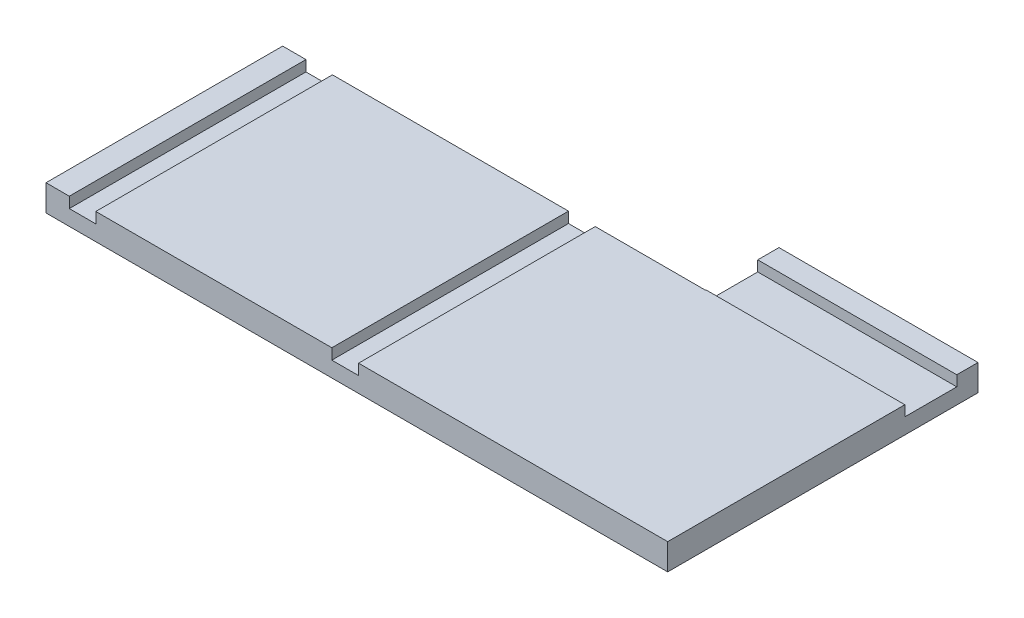
ISO-10303-21;
HEADER;
FILE_DESCRIPTION(('STEP AP214'),'2;1');
FILE_NAME('part.step','',(''),(''),'','','');
FILE_SCHEMA(('AUTOMOTIVE_DESIGN { 1 0 10303 214 1 1 1 1 }'));
ENDSEC;
DATA;
#1=APPLICATION_CONTEXT('core data for automotive mechanical design processes');
#2=APPLICATION_PROTOCOL_DEFINITION('international standard','automotive_design',2000,#1);
#3=PRODUCT_CONTEXT('',#1,'mechanical');
#4=PRODUCT('Part','Part','',(#3));
#5=PRODUCT_RELATED_PRODUCT_CATEGORY('part','',(#4));
#6=PRODUCT_DEFINITION_FORMATION('','',#4);
#7=PRODUCT_DEFINITION_CONTEXT('part definition',#1,'design');
#8=PRODUCT_DEFINITION('design','',#6,#7);
#9=PRODUCT_DEFINITION_SHAPE('','',#8);
#10=(LENGTH_UNIT() NAMED_UNIT(*) SI_UNIT(.MILLI.,.METRE.));
#11=(NAMED_UNIT(*) PLANE_ANGLE_UNIT() SI_UNIT($,.RADIAN.));
#12=(NAMED_UNIT(*) SI_UNIT($,.STERADIAN.) SOLID_ANGLE_UNIT());
#13=UNCERTAINTY_MEASURE_WITH_UNIT(LENGTH_MEASURE(1.E-05),#10,'distance_accuracy_value','');
#14=(GEOMETRIC_REPRESENTATION_CONTEXT(3) GLOBAL_UNCERTAINTY_ASSIGNED_CONTEXT((#13)) GLOBAL_UNIT_ASSIGNED_CONTEXT((#10,
#11,#12)) REPRESENTATION_CONTEXT('',''));
#15=CARTESIAN_POINT('',(0.,0.,0.));
#16=DIRECTION('',(0.,0.,1.));
#17=DIRECTION('',(1.,0.,0.));
#18=AXIS2_PLACEMENT_3D('',#15,#16,#17);
#19=CARTESIAN_POINT('',(0.,5.,-45.1359210528327));
#20=DIRECTION('',(0.,0.,1.));
#21=DIRECTION('',(1.,0.,0.));
#22=AXIS2_PLACEMENT_3D('',#19,#20,#21);
#23=PLANE('',#22);
#24=DIRECTION('',(-1.,0.,0.));
#25=VECTOR('',#24,1.);
#26=CARTESIAN_POINT('',(0.,5.,-45.1359210528327));
#27=LINE('',#26,#25);
#28=CARTESIAN_POINT('',(76.1656796322594,5.,-45.135921052832));
#29=VERTEX_POINT('',#28);
#30=CARTESIAN_POINT('',(55.1699999999999,5.,-45.1359210528327));
#31=VERTEX_POINT('',#30);
#32=EDGE_CURVE('E237',#29,#31,#27,.T.);
#33=ORIENTED_EDGE('',*,*,#32,.F.);
#34=DIRECTION('',(0.,-1.,0.));
#35=VECTOR('',#34,1.);
#36=CARTESIAN_POINT('',(76.1656796322594,5.,-45.1359210528327));
#37=LINE('',#36,#35);
#38=CARTESIAN_POINT('',(76.1656796322594,0.,-45.1359210528327));
#39=VERTEX_POINT('',#38);
#40=EDGE_CURVE('E239',#29,#39,#37,.T.);
#41=ORIENTED_EDGE('',*,*,#40,.T.);
#42=DIRECTION('',(-1.,0.,0.));
#43=VECTOR('',#42,1.);
#44=CARTESIAN_POINT('',(0.,0.,-45.1359210528327));
#45=LINE('',#44,#43);
#46=CARTESIAN_POINT('',(-4.44463618494435,0.,-45.1359210528327));
#47=VERTEX_POINT('',#46);
#48=EDGE_CURVE('E227',#39,#47,#45,.T.);
#49=ORIENTED_EDGE('',*,*,#48,.T.);
#50=DIRECTION('',(0.,1.,0.));
#51=VECTOR('',#50,1.);
#52=CARTESIAN_POINT('',(-4.44463618494435,0.,-45.1359210528327));
#53=LINE('',#52,#51);
#54=CARTESIAN_POINT('',(-4.44463618494435,5.,-45.1359210528327));
#55=VERTEX_POINT('',#54);
#56=EDGE_CURVE('E305',#47,#55,#53,.T.);
#57=ORIENTED_EDGE('',*,*,#56,.T.);
#58=DIRECTION('',(1.,0.,0.));
#59=VECTOR('',#58,1.);
#60=CARTESIAN_POINT('',(0.,5.,-45.1359210528327));
#61=LINE('',#60,#59);
#62=CARTESIAN_POINT('',(0.,5.,-45.1359210528327));
#63=VERTEX_POINT('',#62);
#64=EDGE_CURVE('E175',#55,#63,#61,.T.);
#65=ORIENTED_EDGE('',*,*,#64,.T.);
#66=DIRECTION('',(0.,-1.,0.));
#67=VECTOR('',#66,1.);
#68=CARTESIAN_POINT('',(0.,0.,-45.1359210528327));
#69=LINE('',#68,#67);
#70=CARTESIAN_POINT('',(0.,2.95000000000002,-45.1359210528327));
#71=VERTEX_POINT('',#70);
#72=EDGE_CURVE('E179',#63,#71,#69,.T.);
#73=ORIENTED_EDGE('',*,*,#72,.T.);
#74=DIRECTION('',(1.,0.,0.));
#75=VECTOR('',#74,1.);
#76=CARTESIAN_POINT('',(0.,2.95000000000002,-45.1359210528327));
#77=LINE('',#76,#75);
#78=CARTESIAN_POINT('',(5.04999999999995,2.95000000000002,-45.1359210528327));
#79=VERTEX_POINT('',#78);
#80=EDGE_CURVE('E41',#71,#79,#77,.T.);
#81=ORIENTED_EDGE('',*,*,#80,.T.);
#82=DIRECTION('',(0.,1.,0.));
#83=VECTOR('',#82,1.);
#84=CARTESIAN_POINT('',(5.04999999999995,5.,-45.1359210528327));
#85=LINE('',#84,#83);
#86=CARTESIAN_POINT('',(5.04999999999995,5.,-45.1359210528327));
#87=VERTEX_POINT('',#86);
#88=EDGE_CURVE('E208',#79,#87,#85,.T.);
#89=ORIENTED_EDGE('',*,*,#88,.T.);
#90=CARTESIAN_POINT('',(50.0699999999999,5.,-45.1359210528327));
#91=VERTEX_POINT('',#90);
#92=EDGE_CURVE('E236',#91,#87,#27,.T.);
#93=ORIENTED_EDGE('',*,*,#92,.F.);
#94=DIRECTION('',(0.,-1.,0.));
#95=VECTOR('',#94,1.);
#96=CARTESIAN_POINT('',(50.0699999999999,5.,-45.1359210528327));
#97=LINE('',#96,#95);
#98=CARTESIAN_POINT('',(50.0699999999999,2.95,-45.1359210528327));
#99=VERTEX_POINT('',#98);
#100=EDGE_CURVE('E203',#91,#99,#97,.T.);
#101=ORIENTED_EDGE('',*,*,#100,.T.);
#102=DIRECTION('',(1.,0.,0.));
#103=VECTOR('',#102,1.);
#104=CARTESIAN_POINT('',(0.,2.95,-45.1359210528327));
#105=LINE('',#104,#103);
#106=CARTESIAN_POINT('',(55.1699999999999,2.95,-45.1359210528327));
#107=VERTEX_POINT('',#106);
#108=EDGE_CURVE('E269',#99,#107,#105,.T.);
#109=ORIENTED_EDGE('',*,*,#108,.T.);
#110=DIRECTION('',(0.,1.,0.));
#111=VECTOR('',#110,1.);
#112=CARTESIAN_POINT('',(55.1699999999999,5.,-45.1359210528327));
#113=LINE('',#112,#111);
#114=EDGE_CURVE('E192',#107,#31,#113,.T.);
#115=ORIENTED_EDGE('',*,*,#114,.T.);
#116=EDGE_LOOP('',(#33,#41,#49,#57,#65,#73,#81,#89,#93,#101,#109,#115));
#117=FACE_BOUND('',#116,.T.);
#118=ADVANCED_FACE('F33',(#117),#23,.F.);
#119=CARTESIAN_POINT('',(0.,5.,0.));
#120=DIRECTION('',(0.,-1.,0.));
#121=DIRECTION('',(0.,0.,-1.));
#122=AXIS2_PLACEMENT_3D('',#119,#120,#121);
#123=PLANE('',#122);
#124=DIRECTION('',(0.,0.,-1.));
#125=VECTOR('',#124,1.);
#126=CARTESIAN_POINT('',(114.126652136349,5.,0.));
#127=LINE('',#126,#125);
#128=CARTESIAN_POINT('',(114.126652136349,5.,0.));
#129=VERTEX_POINT('',#128);
#130=CARTESIAN_POINT('',(114.126652136349,5.,-45.235921052832));
#131=VERTEX_POINT('',#130);
#132=EDGE_CURVE('E228',#129,#131,#127,.T.);
#133=ORIENTED_EDGE('',*,*,#132,.T.);
#134=DIRECTION('',(1.,0.,0.));
#135=VECTOR('',#134,1.);
#136=CARTESIAN_POINT('',(74.1631811928093,5.,-45.235921052832));
#137=LINE('',#136,#135);
#138=CARTESIAN_POINT('',(76.1656796322594,5.,-45.235921052832));
#139=VERTEX_POINT('',#138);
#140=EDGE_CURVE('E161',#139,#131,#137,.T.);
#141=ORIENTED_EDGE('',*,*,#140,.F.);
#142=DIRECTION('',(0.,0.,-1.));
#143=VECTOR('',#142,1.);
#144=CARTESIAN_POINT('',(76.1656796322594,5.,-45.135921052832));
#145=LINE('',#144,#143);
#146=EDGE_CURVE('E291',#29,#139,#145,.T.);
#147=ORIENTED_EDGE('',*,*,#146,.F.);
#148=ORIENTED_EDGE('',*,*,#32,.T.);
#149=DIRECTION('',(0.,0.,1.));
#150=VECTOR('',#149,1.);
#151=CARTESIAN_POINT('',(55.1699999999999,5.,0.));
#152=LINE('',#151,#150);
#153=CARTESIAN_POINT('',(55.1699999999999,5.,0.));
#154=VERTEX_POINT('',#153);
#155=EDGE_CURVE('E260',#31,#154,#152,.T.);
#156=ORIENTED_EDGE('',*,*,#155,.T.);
#157=DIRECTION('',(1.,0.,0.));
#158=VECTOR('',#157,1.);
#159=CARTESIAN_POINT('',(0.,5.,0.));
#160=LINE('',#159,#158);
#161=EDGE_CURVE('E224',#154,#129,#160,.T.);
#162=ORIENTED_EDGE('',*,*,#161,.T.);
#163=EDGE_LOOP('',(#133,#141,#147,#148,#156,#162));
#164=FACE_BOUND('',#163,.T.);
#165=ADVANCED_FACE('F325',(#164),#123,.F.);
#166=ORIENTED_EDGE('',*,*,#92,.T.);
#167=DIRECTION('',(0.,0.,1.));
#168=VECTOR('',#167,1.);
#169=CARTESIAN_POINT('',(5.04999999999995,5.,0.));
#170=LINE('',#169,#168);
#171=CARTESIAN_POINT('',(5.04999999999995,5.,0.));
#172=VERTEX_POINT('',#171);
#173=EDGE_CURVE('E266',#87,#172,#170,.T.);
#174=ORIENTED_EDGE('',*,*,#173,.T.);
#175=CARTESIAN_POINT('',(50.0699999999999,5.,0.));
#176=VERTEX_POINT('',#175);
#177=EDGE_CURVE('E226',#172,#176,#160,.T.);
#178=ORIENTED_EDGE('',*,*,#177,.T.);
#179=DIRECTION('',(0.,0.,-1.));
#180=VECTOR('',#179,1.);
#181=CARTESIAN_POINT('',(50.0699999999999,5.,0.));
#182=LINE('',#181,#180);
#183=EDGE_CURVE('E263',#176,#91,#182,.T.);
#184=ORIENTED_EDGE('',*,*,#183,.T.);
#185=EDGE_LOOP('',(#166,#174,#178,#184));
#186=FACE_BOUND('',#185,.T.);
#187=ADVANCED_FACE('F319',(#186),#123,.F.);
#188=CARTESIAN_POINT('',(0.,5.,0.));
#189=DIRECTION('',(0.,0.,-1.));
#190=DIRECTION('',(-1.,0.,0.));
#191=AXIS2_PLACEMENT_3D('',#188,#189,#190);
#192=PLANE('',#191);
#193=ORIENTED_EDGE('',*,*,#177,.F.);
#194=DIRECTION('',(0.,-1.,0.));
#195=VECTOR('',#194,1.);
#196=CARTESIAN_POINT('',(5.04999999999995,5.,0.));
#197=LINE('',#196,#195);
#198=CARTESIAN_POINT('',(5.04999999999995,2.95000000000002,0.));
#199=VERTEX_POINT('',#198);
#200=EDGE_CURVE('E211',#172,#199,#197,.T.);
#201=ORIENTED_EDGE('',*,*,#200,.T.);
#202=DIRECTION('',(-1.,0.,0.));
#203=VECTOR('',#202,1.);
#204=CARTESIAN_POINT('',(0.,2.95000000000002,0.));
#205=LINE('',#204,#203);
#206=CARTESIAN_POINT('',(0.,2.95000000000002,0.));
#207=VERTEX_POINT('',#206);
#208=EDGE_CURVE('E220',#199,#207,#205,.T.);
#209=ORIENTED_EDGE('',*,*,#208,.T.);
#210=DIRECTION('',(0.,1.,0.));
#211=VECTOR('',#210,1.);
#212=CARTESIAN_POINT('',(0.,0.,0.));
#213=LINE('',#212,#211);
#214=CARTESIAN_POINT('',(0.,5.,0.));
#215=VERTEX_POINT('',#214);
#216=EDGE_CURVE('E285',#207,#215,#213,.T.);
#217=ORIENTED_EDGE('',*,*,#216,.T.);
#218=DIRECTION('',(-1.,0.,0.));
#219=VECTOR('',#218,1.);
#220=CARTESIAN_POINT('',(0.,5.,0.));
#221=LINE('',#220,#219);
#222=CARTESIAN_POINT('',(-4.44463618494435,5.,0.));
#223=VERTEX_POINT('',#222);
#224=EDGE_CURVE('E290',#215,#223,#221,.T.);
#225=ORIENTED_EDGE('',*,*,#224,.T.);
#226=DIRECTION('',(0.,-1.,0.));
#227=VECTOR('',#226,1.);
#228=CARTESIAN_POINT('',(-4.44463618494435,0.,0.));
#229=LINE('',#228,#227);
#230=CARTESIAN_POINT('',(-4.44463618494435,0.,0.));
#231=VERTEX_POINT('',#230);
#232=EDGE_CURVE('E293',#223,#231,#229,.T.);
#233=ORIENTED_EDGE('',*,*,#232,.T.);
#234=DIRECTION('',(1.,0.,0.));
#235=VECTOR('',#234,1.);
#236=CARTESIAN_POINT('',(0.,0.,0.));
#237=LINE('',#236,#235);
#238=CARTESIAN_POINT('',(114.126652136349,0.,0.));
#239=VERTEX_POINT('',#238);
#240=EDGE_CURVE('E223',#231,#239,#237,.T.);
#241=ORIENTED_EDGE('',*,*,#240,.T.);
#242=DIRECTION('',(0.,-1.,0.));
#243=VECTOR('',#242,1.);
#244=CARTESIAN_POINT('',(114.126652136349,5.,0.));
#245=LINE('',#244,#243);
#246=EDGE_CURVE('E257',#129,#239,#245,.T.);
#247=ORIENTED_EDGE('',*,*,#246,.F.);
#248=ORIENTED_EDGE('',*,*,#161,.F.);
#249=DIRECTION('',(0.,-1.,0.));
#250=VECTOR('',#249,1.);
#251=CARTESIAN_POINT('',(55.1699999999999,5.,0.));
#252=LINE('',#251,#250);
#253=CARTESIAN_POINT('',(55.1699999999999,2.95,0.));
#254=VERTEX_POINT('',#253);
#255=EDGE_CURVE('E200',#154,#254,#252,.T.);
#256=ORIENTED_EDGE('',*,*,#255,.T.);
#257=DIRECTION('',(-1.,0.,0.));
#258=VECTOR('',#257,1.);
#259=CARTESIAN_POINT('',(0.,2.95,0.));
#260=LINE('',#259,#258);
#261=CARTESIAN_POINT('',(50.0699999999999,2.95,0.));
#262=VERTEX_POINT('',#261);
#263=EDGE_CURVE('E214',#254,#262,#260,.T.);
#264=ORIENTED_EDGE('',*,*,#263,.T.);
#265=DIRECTION('',(0.,1.,0.));
#266=VECTOR('',#265,1.);
#267=CARTESIAN_POINT('',(50.0699999999999,5.,0.));
#268=LINE('',#267,#266);
#269=EDGE_CURVE('E205',#262,#176,#268,.T.);
#270=ORIENTED_EDGE('',*,*,#269,.T.);
#271=EDGE_LOOP('',(#193,#201,#209,#217,#225,#233,#241,#247,#248,#256,#264,#270));
#272=FACE_BOUND('',#271,.T.);
#273=ADVANCED_FACE('F35',(#272),#192,.F.);
#274=CARTESIAN_POINT('',(114.126652136349,5.,-45.1359210528327));
#275=DIRECTION('',(-1.,0.,0.));
#276=DIRECTION('',(0.,0.,1.));
#277=AXIS2_PLACEMENT_3D('',#274,#275,#276);
#278=PLANE('',#277);
#279=DIRECTION('',(0.,0.,-1.));
#280=VECTOR('',#279,1.);
#281=CARTESIAN_POINT('',(114.126652136334,3.,-45.135921052832));
#282=LINE('',#281,#280);
#283=CARTESIAN_POINT('',(114.126652136349,3.,-45.235921052832));
#284=VERTEX_POINT('',#283);
#285=CARTESIAN_POINT('',(114.126652136334,3.,-55.135921052832));
#286=VERTEX_POINT('',#285);
#287=EDGE_CURVE('E170',#284,#286,#282,.T.);
#288=ORIENTED_EDGE('',*,*,#287,.F.);
#289=DIRECTION('',(0.,1.,0.));
#290=VECTOR('',#289,1.);
#291=CARTESIAN_POINT('',(114.126652136349,3.,-45.235921052832));
#292=LINE('',#291,#290);
#293=EDGE_CURVE('E158',#284,#131,#292,.T.);
#294=ORIENTED_EDGE('',*,*,#293,.T.);
#295=ORIENTED_EDGE('',*,*,#132,.F.);
#296=ORIENTED_EDGE('',*,*,#246,.T.);
#297=DIRECTION('',(0.,0.,-1.));
#298=VECTOR('',#297,1.);
#299=CARTESIAN_POINT('',(114.126652136349,0.,-45.1359210528327));
#300=LINE('',#299,#298);
#301=CARTESIAN_POINT('',(114.126652136349,0.,-59.1838595996634));
#302=VERTEX_POINT('',#301);
#303=EDGE_CURVE('E242',#239,#302,#300,.T.);
#304=ORIENTED_EDGE('',*,*,#303,.T.);
#305=DIRECTION('',(0.,-1.,0.));
#306=VECTOR('',#305,1.);
#307=CARTESIAN_POINT('',(114.126652136349,5.,-59.1838595996634));
#308=LINE('',#307,#306);
#309=CARTESIAN_POINT('',(114.126652136349,5.,-59.1838595996634));
#310=VERTEX_POINT('',#309);
#311=EDGE_CURVE('E254',#310,#302,#308,.T.);
#312=ORIENTED_EDGE('',*,*,#311,.F.);
#313=CARTESIAN_POINT('',(114.126652136349,5.,-55.135921052832));
#314=VERTEX_POINT('',#313);
#315=EDGE_CURVE('E231',#314,#310,#127,.T.);
#316=ORIENTED_EDGE('',*,*,#315,.F.);
#317=DIRECTION('',(1.43288159115684E-11,1.,0.));
#318=VECTOR('',#317,1.);
#319=CARTESIAN_POINT('',(114.126652136363,5.,-55.135921052832));
#320=LINE('',#319,#318);
#321=EDGE_CURVE('E56',#286,#314,#320,.T.);
#322=ORIENTED_EDGE('',*,*,#321,.F.);
#323=EDGE_LOOP('',(#288,#294,#295,#296,#304,#312,#316,#322));
#324=FACE_BOUND('',#323,.T.);
#325=ADVANCED_FACE('F173',(#324),#278,.F.);
#326=CARTESIAN_POINT('',(114.126652136349,5.,-59.1838595996634));
#327=DIRECTION('',(0.,0.,1.));
#328=DIRECTION('',(1.,0.,0.));
#329=AXIS2_PLACEMENT_3D('',#326,#327,#328);
#330=PLANE('',#329);
#331=DIRECTION('',(-1.,0.,0.));
#332=VECTOR('',#331,1.);
#333=CARTESIAN_POINT('',(114.126652136349,0.,-59.1838595996634));
#334=LINE('',#333,#332);
#335=CARTESIAN_POINT('',(76.1656796322594,0.,-59.1838595996634));
#336=VERTEX_POINT('',#335);
#337=EDGE_CURVE('E244',#302,#336,#334,.T.);
#338=ORIENTED_EDGE('',*,*,#337,.T.);
#339=DIRECTION('',(0.,-1.,0.));
#340=VECTOR('',#339,1.);
#341=CARTESIAN_POINT('',(76.1656796322594,5.,-59.1838595996634));
#342=LINE('',#341,#340);
#343=CARTESIAN_POINT('',(76.1656796322594,5.,-59.1838595996634));
#344=VERTEX_POINT('',#343);
#345=EDGE_CURVE('E251',#344,#336,#342,.T.);
#346=ORIENTED_EDGE('',*,*,#345,.F.);
#347=DIRECTION('',(-1.,0.,0.));
#348=VECTOR('',#347,1.);
#349=CARTESIAN_POINT('',(114.126652136349,5.,-59.1838595996634));
#350=LINE('',#349,#348);
#351=EDGE_CURVE('E230',#310,#344,#350,.T.);
#352=ORIENTED_EDGE('',*,*,#351,.F.);
#353=ORIENTED_EDGE('',*,*,#311,.T.);
#354=EDGE_LOOP('',(#338,#346,#352,#353));
#355=FACE_BOUND('',#354,.T.);
#356=ADVANCED_FACE('F324',(#355),#330,.F.);
#357=CARTESIAN_POINT('',(76.1656796322594,5.,-45.1359210528327));
#358=DIRECTION('',(1.,0.,0.));
#359=DIRECTION('',(0.,0.,-1.));
#360=AXIS2_PLACEMENT_3D('',#357,#358,#359);
#361=PLANE('',#360);
#362=ORIENTED_EDGE('',*,*,#40,.F.);
#363=ORIENTED_EDGE('',*,*,#146,.T.);
#364=DIRECTION('',(0.,-1.,0.));
#365=VECTOR('',#364,1.);
#366=CARTESIAN_POINT('',(76.1656796322594,3.,-45.235921052832));
#367=LINE('',#366,#365);
#368=CARTESIAN_POINT('',(76.1656796322594,3.000000000544,-45.235921052832));
#369=VERTEX_POINT('',#368);
#370=EDGE_CURVE('E295',#139,#369,#367,.T.);
#371=ORIENTED_EDGE('',*,*,#370,.T.);
#372=DIRECTION('',(0.,0.,-1.));
#373=VECTOR('',#372,1.);
#374=CARTESIAN_POINT('',(76.1656796322594,3.000000000544,-45.1359210528327));
#375=LINE('',#374,#373);
#376=CARTESIAN_POINT('',(76.1656796322594,3.000000000544,-55.1359210528321));
#377=VERTEX_POINT('',#376);
#378=EDGE_CURVE('E171',#369,#377,#375,.T.);
#379=ORIENTED_EDGE('',*,*,#378,.T.);
#380=DIRECTION('',(0.,1.,0.));
#381=VECTOR('',#380,1.);
#382=CARTESIAN_POINT('',(76.1656796322594,5.,-55.1359210528321));
#383=LINE('',#382,#381);
#384=CARTESIAN_POINT('',(76.1656796322594,5.000000000544,-55.1359210528321));
#385=VERTEX_POINT('',#384);
#386=EDGE_CURVE('E184',#377,#385,#383,.T.);
#387=ORIENTED_EDGE('',*,*,#386,.T.);
#388=DIRECTION('',(0.,0.,1.));
#389=VECTOR('',#388,1.);
#390=CARTESIAN_POINT('',(76.1656796322594,5.,-45.1359210528327));
#391=LINE('',#390,#389);
#392=EDGE_CURVE('E233',#344,#385,#391,.T.);
#393=ORIENTED_EDGE('',*,*,#392,.F.);
#394=ORIENTED_EDGE('',*,*,#345,.T.);
#395=DIRECTION('',(0.,0.,1.));
#396=VECTOR('',#395,1.);
#397=CARTESIAN_POINT('',(76.1656796322594,0.,-45.1359210528327));
#398=LINE('',#397,#396);
#399=EDGE_CURVE('E246',#336,#39,#398,.T.);
#400=ORIENTED_EDGE('',*,*,#399,.T.);
#401=EDGE_LOOP('',(#362,#363,#371,#379,#387,#393,#394,#400));
#402=FACE_BOUND('',#401,.T.);
#403=ADVANCED_FACE('F338',(#402),#361,.F.);
#404=ORIENTED_EDGE('',*,*,#392,.T.);
#405=DIRECTION('',(1.,0.,0.));
#406=VECTOR('',#405,1.);
#407=CARTESIAN_POINT('',(0.,5.,-55.1359210528322));
#408=LINE('',#407,#406);
#409=EDGE_CURVE('E11',#385,#314,#408,.T.);
#410=ORIENTED_EDGE('',*,*,#409,.T.);
#411=ORIENTED_EDGE('',*,*,#315,.T.);
#412=ORIENTED_EDGE('',*,*,#351,.T.);
#413=EDGE_LOOP('',(#404,#410,#411,#412));
#414=FACE_BOUND('',#413,.T.);
#415=ADVANCED_FACE('F328',(#414),#123,.F.);
#416=CARTESIAN_POINT('',(0.,0.,0.));
#417=DIRECTION('',(0.,-1.,0.));
#418=DIRECTION('',(0.,0.,-1.));
#419=AXIS2_PLACEMENT_3D('',#416,#417,#418);
#420=PLANE('',#419);
#421=ORIENTED_EDGE('',*,*,#240,.F.);
#422=DIRECTION('',(0.,0.,1.));
#423=VECTOR('',#422,1.);
#424=CARTESIAN_POINT('',(-4.44463618494435,0.,-51.825823205818));
#425=LINE('',#424,#423);
#426=EDGE_CURVE('E302',#47,#231,#425,.T.);
#427=ORIENTED_EDGE('',*,*,#426,.F.);
#428=ORIENTED_EDGE('',*,*,#48,.F.);
#429=ORIENTED_EDGE('',*,*,#399,.F.);
#430=ORIENTED_EDGE('',*,*,#337,.F.);
#431=ORIENTED_EDGE('',*,*,#303,.F.);
#432=EDGE_LOOP('',(#421,#427,#428,#429,#430,#431));
#433=FACE_BOUND('',#432,.T.);
#434=ADVANCED_FACE('F337',(#433),#420,.T.);
#435=CARTESIAN_POINT('',(50.0699999999999,2.95,-59.1838595996634));
#436=DIRECTION('',(0.,-1.,0.));
#437=DIRECTION('',(0.,0.,-1.));
#438=AXIS2_PLACEMENT_3D('',#435,#436,#437);
#439=PLANE('',#438);
#440=DIRECTION('',(0.,0.,1.));
#441=VECTOR('',#440,1.);
#442=CARTESIAN_POINT('',(55.1699999999999,2.95,-59.1838595996634));
#443=LINE('',#442,#441);
#444=EDGE_CURVE('E193',#107,#254,#443,.T.);
#445=ORIENTED_EDGE('',*,*,#444,.F.);
#446=ORIENTED_EDGE('',*,*,#108,.F.);
#447=DIRECTION('',(0.,0.,1.));
#448=VECTOR('',#447,1.);
#449=CARTESIAN_POINT('',(50.0699999999999,2.95,-59.1838595996634));
#450=LINE('',#449,#448);
#451=EDGE_CURVE('E188',#99,#262,#450,.T.);
#452=ORIENTED_EDGE('',*,*,#451,.T.);
#453=ORIENTED_EDGE('',*,*,#263,.F.);
#454=EDGE_LOOP('',(#445,#446,#452,#453));
#455=FACE_BOUND('',#454,.T.);
#456=ADVANCED_FACE('F366',(#455),#439,.F.);
#457=CARTESIAN_POINT('',(50.0699999999999,2.95,-59.1838595996634));
#458=DIRECTION('',(-1.,0.,0.));
#459=DIRECTION('',(0.,0.,1.));
#460=AXIS2_PLACEMENT_3D('',#457,#458,#459);
#461=PLANE('',#460);
#462=ORIENTED_EDGE('',*,*,#451,.F.);
#463=ORIENTED_EDGE('',*,*,#100,.F.);
#464=ORIENTED_EDGE('',*,*,#183,.F.);
#465=ORIENTED_EDGE('',*,*,#269,.F.);
#466=EDGE_LOOP('',(#462,#463,#464,#465));
#467=FACE_BOUND('',#466,.T.);
#468=ADVANCED_FACE('F369',(#467),#461,.F.);
#469=CARTESIAN_POINT('',(55.1699999999999,2.95,-59.1838595996634));
#470=DIRECTION('',(1.,0.,0.));
#471=DIRECTION('',(0.,0.,-1.));
#472=AXIS2_PLACEMENT_3D('',#469,#470,#471);
#473=PLANE('',#472);
#474=ORIENTED_EDGE('',*,*,#155,.F.);
#475=ORIENTED_EDGE('',*,*,#114,.F.);
#476=ORIENTED_EDGE('',*,*,#444,.T.);
#477=ORIENTED_EDGE('',*,*,#255,.F.);
#478=EDGE_LOOP('',(#474,#475,#476,#477));
#479=FACE_BOUND('',#478,.T.);
#480=ADVANCED_FACE('F362',(#479),#473,.F.);
#481=CARTESIAN_POINT('',(-0.0500000000000496,2.95000000000002,-59.1838595996634));
#482=DIRECTION('',(0.,-1.,0.));
#483=DIRECTION('',(0.,0.,-1.));
#484=AXIS2_PLACEMENT_3D('',#481,#482,#483);
#485=PLANE('',#484);
#486=DIRECTION('',(0.,0.,1.));
#487=VECTOR('',#486,1.);
#488=CARTESIAN_POINT('',(5.04999999999995,2.95000000000002,-59.1838595996634));
#489=LINE('',#488,#487);
#490=EDGE_CURVE('E189',#79,#199,#489,.T.);
#491=ORIENTED_EDGE('',*,*,#490,.F.);
#492=ORIENTED_EDGE('',*,*,#80,.F.);
#493=DIRECTION('',(0.,0.,-1.));
#494=VECTOR('',#493,1.);
#495=CARTESIAN_POINT('',(0.,2.95000000000002,0.));
#496=LINE('',#495,#494);
#497=EDGE_CURVE('E217',#207,#71,#496,.T.);
#498=ORIENTED_EDGE('',*,*,#497,.F.);
#499=ORIENTED_EDGE('',*,*,#208,.F.);
#500=EDGE_LOOP('',(#491,#492,#498,#499));
#501=FACE_BOUND('',#500,.T.);
#502=ADVANCED_FACE('F279',(#501),#485,.F.);
#503=CARTESIAN_POINT('',(5.04999999999995,2.95000000000002,-59.1838595996634));
#504=DIRECTION('',(1.,0.,0.));
#505=DIRECTION('',(0.,0.,-1.));
#506=AXIS2_PLACEMENT_3D('',#503,#504,#505);
#507=PLANE('',#506);
#508=ORIENTED_EDGE('',*,*,#173,.F.);
#509=ORIENTED_EDGE('',*,*,#88,.F.);
#510=ORIENTED_EDGE('',*,*,#490,.T.);
#511=ORIENTED_EDGE('',*,*,#200,.F.);
#512=EDGE_LOOP('',(#508,#509,#510,#511));
#513=FACE_BOUND('',#512,.T.);
#514=ADVANCED_FACE('F380',(#513),#507,.F.);
#515=CARTESIAN_POINT('',(37.3619609728001,3.00000000110008,-45.1359210528322));
#516=DIRECTION('',(-1.4330482854368E-11,-1.,0.));
#517=DIRECTION('',(1.,-1.4330482854368E-11,0.));
#518=AXIS2_PLACEMENT_3D('',#515,#516,#517);
#519=PLANE('',#518);
#520=ORIENTED_EDGE('',*,*,#378,.F.);
#521=DIRECTION('',(1.,0.,0.));
#522=VECTOR('',#521,1.);
#523=CARTESIAN_POINT('',(74.1631811928093,3.,-45.235921052832));
#524=LINE('',#523,#522);
#525=EDGE_CURVE('E48',#369,#284,#524,.T.);
#526=ORIENTED_EDGE('',*,*,#525,.T.);
#527=ORIENTED_EDGE('',*,*,#287,.T.);
#528=DIRECTION('',(1.,-1.4330482854368E-11,0.));
#529=VECTOR('',#528,1.);
#530=CARTESIAN_POINT('',(37.3619609728001,3.00000000110008,-55.1359210528322));
#531=LINE('',#530,#529);
#532=EDGE_CURVE('E177',#377,#286,#531,.T.);
#533=ORIENTED_EDGE('',*,*,#532,.F.);
#534=EDGE_LOOP('',(#520,#526,#527,#533));
#535=FACE_BOUND('',#534,.T.);
#536=ADVANCED_FACE('F168',(#535),#519,.F.);
#537=CARTESIAN_POINT('',(37.3619609728287,5.00000000110007,-55.1359210528322));
#538=DIRECTION('',(0.,0.,-1.));
#539=DIRECTION('',(-1.,0.,0.));
#540=AXIS2_PLACEMENT_3D('',#537,#538,#539);
#541=PLANE('',#540);
#542=ORIENTED_EDGE('',*,*,#532,.T.);
#543=ORIENTED_EDGE('',*,*,#321,.T.);
#544=ORIENTED_EDGE('',*,*,#409,.F.);
#545=ORIENTED_EDGE('',*,*,#386,.F.);
#546=EDGE_LOOP('',(#542,#543,#544,#545));
#547=FACE_BOUND('',#546,.T.);
#548=ADVANCED_FACE('F372',(#547),#541,.F.);
#549=CARTESIAN_POINT('',(0.,0.,-51.825823205818));
#550=DIRECTION('',(1.,0.,0.));
#551=DIRECTION('',(0.,0.,-1.));
#552=AXIS2_PLACEMENT_3D('',#549,#550,#551);
#553=PLANE('',#552);
#554=ORIENTED_EDGE('',*,*,#216,.F.);
#555=ORIENTED_EDGE('',*,*,#497,.T.);
#556=ORIENTED_EDGE('',*,*,#72,.F.);
#557=DIRECTION('',(0.,0.,1.));
#558=VECTOR('',#557,1.);
#559=CARTESIAN_POINT('',(0.,5.,-51.825823205818));
#560=LINE('',#559,#558);
#561=EDGE_CURVE('E286',#63,#215,#560,.T.);
#562=ORIENTED_EDGE('',*,*,#561,.T.);
#563=EDGE_LOOP('',(#554,#555,#556,#562));
#564=FACE_BOUND('',#563,.T.);
#565=ADVANCED_FACE('F282',(#564),#553,.T.);
#566=CARTESIAN_POINT('',(-4.44463618494435,0.,-51.825823205818));
#567=DIRECTION('',(-1.,0.,0.));
#568=DIRECTION('',(0.,0.,1.));
#569=AXIS2_PLACEMENT_3D('',#566,#567,#568);
#570=PLANE('',#569);
#571=ORIENTED_EDGE('',*,*,#56,.F.);
#572=ORIENTED_EDGE('',*,*,#426,.T.);
#573=ORIENTED_EDGE('',*,*,#232,.F.);
#574=DIRECTION('',(0.,0.,1.));
#575=VECTOR('',#574,1.);
#576=CARTESIAN_POINT('',(-4.44463618494435,5.,-51.825823205818));
#577=LINE('',#576,#575);
#578=EDGE_CURVE('E306',#55,#223,#577,.T.);
#579=ORIENTED_EDGE('',*,*,#578,.F.);
#580=EDGE_LOOP('',(#571,#572,#573,#579));
#581=FACE_BOUND('',#580,.T.);
#582=ADVANCED_FACE('F314',(#581),#570,.T.);
#583=CARTESIAN_POINT('',(0.,5.,-51.825823205818));
#584=DIRECTION('',(0.,1.,0.));
#585=DIRECTION('',(0.,0.,1.));
#586=AXIS2_PLACEMENT_3D('',#583,#584,#585);
#587=PLANE('',#586);
#588=ORIENTED_EDGE('',*,*,#64,.F.);
#589=ORIENTED_EDGE('',*,*,#578,.T.);
#590=ORIENTED_EDGE('',*,*,#224,.F.);
#591=ORIENTED_EDGE('',*,*,#561,.F.);
#592=EDGE_LOOP('',(#588,#589,#590,#591));
#593=FACE_BOUND('',#592,.T.);
#594=ADVANCED_FACE('F311',(#593),#587,.T.);
#595=CARTESIAN_POINT('',(74.1631811928093,3.,-45.235921052832));
#596=DIRECTION('',(0.,0.,-1.));
#597=DIRECTION('',(-1.,0.,0.));
#598=AXIS2_PLACEMENT_3D('',#595,#596,#597);
#599=PLANE('',#598);
#600=ORIENTED_EDGE('',*,*,#370,.F.);
#601=ORIENTED_EDGE('',*,*,#140,.T.);
#602=ORIENTED_EDGE('',*,*,#293,.F.);
#603=ORIENTED_EDGE('',*,*,#525,.F.);
#604=EDGE_LOOP('',(#600,#601,#602,#603));
#605=FACE_BOUND('',#604,.T.);
#606=ADVANCED_FACE('F159',(#605),#599,.T.);
#607=CLOSED_SHELL('',(#118,#165,#187,#273,#325,#356,#403,#415,#434,#456,#468,#480,#502,#514,
#536,#548,#565,#582,#594,#606));
#608=MANIFOLD_SOLID_BREP('B2',#607);
#609=ADVANCED_BREP_SHAPE_REPRESENTATION('',(#18,#608),#14);
#610=SHAPE_DEFINITION_REPRESENTATION(#9,#609);
ENDSEC;
END-ISO-10303-21;
